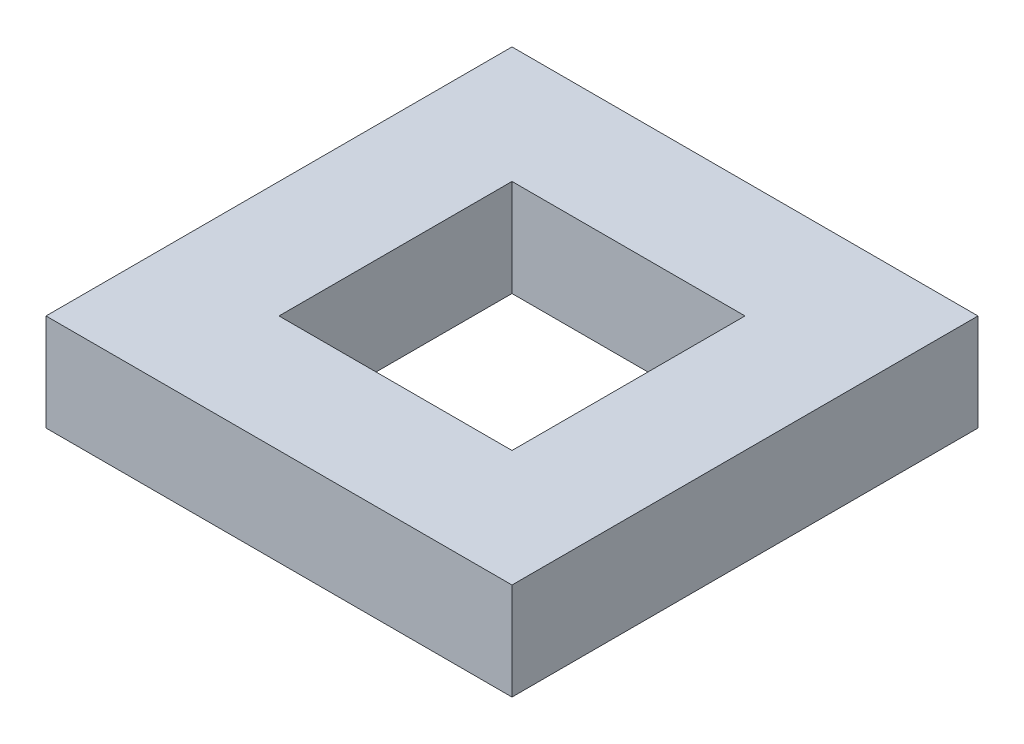
ISO-10303-21;
HEADER;
FILE_DESCRIPTION(('STEP AP214'),'2;1');
FILE_NAME('part.step','',(''),(''),'','','');
FILE_SCHEMA(('AUTOMOTIVE_DESIGN { 1 0 10303 214 1 1 1 1 }'));
ENDSEC;
DATA;
#1=APPLICATION_CONTEXT('core data for automotive mechanical design processes');
#2=APPLICATION_PROTOCOL_DEFINITION('international standard','automotive_design',2000,#1);
#3=PRODUCT_CONTEXT('',#1,'mechanical');
#4=PRODUCT('Part','Part','',(#3));
#5=PRODUCT_RELATED_PRODUCT_CATEGORY('part','',(#4));
#6=PRODUCT_DEFINITION_FORMATION('','',#4);
#7=PRODUCT_DEFINITION_CONTEXT('part definition',#1,'design');
#8=PRODUCT_DEFINITION('design','',#6,#7);
#9=PRODUCT_DEFINITION_SHAPE('','',#8);
#10=(LENGTH_UNIT() NAMED_UNIT(*) SI_UNIT(.MILLI.,.METRE.));
#11=(NAMED_UNIT(*) PLANE_ANGLE_UNIT() SI_UNIT($,.RADIAN.));
#12=(NAMED_UNIT(*) SI_UNIT($,.STERADIAN.) SOLID_ANGLE_UNIT());
#13=UNCERTAINTY_MEASURE_WITH_UNIT(LENGTH_MEASURE(1.E-05),#10,'distance_accuracy_value','');
#14=(GEOMETRIC_REPRESENTATION_CONTEXT(3) GLOBAL_UNCERTAINTY_ASSIGNED_CONTEXT((#13)) GLOBAL_UNIT_ASSIGNED_CONTEXT((#10,
#11,#12)) REPRESENTATION_CONTEXT('',''));
#15=CARTESIAN_POINT('',(0.,0.,0.));
#16=DIRECTION('',(0.,0.,1.));
#17=DIRECTION('',(1.,0.,0.));
#18=AXIS2_PLACEMENT_3D('',#15,#16,#17);
#19=CARTESIAN_POINT('',(0.,3.175,0.));
#20=DIRECTION('',(0.,-1.,0.));
#21=DIRECTION('',(0.,0.,-1.));
#22=AXIS2_PLACEMENT_3D('',#19,#20,#21);
#23=PLANE('',#22);
#24=DIRECTION('',(0.,0.,1.));
#25=VECTOR('',#24,1.);
#26=CARTESIAN_POINT('',(0.,3.175,0.));
#27=LINE('',#26,#25);
#28=CARTESIAN_POINT('',(0.,3.175,-15.24));
#29=VERTEX_POINT('',#28);
#30=CARTESIAN_POINT('',(0.,3.175,0.));
#31=VERTEX_POINT('',#30);
#32=EDGE_CURVE('E134',#29,#31,#27,.T.);
#33=ORIENTED_EDGE('',*,*,#32,.T.);
#34=DIRECTION('',(1.,0.,0.));
#35=VECTOR('',#34,1.);
#36=CARTESIAN_POINT('',(0.,3.175,0.));
#37=LINE('',#36,#35);
#38=CARTESIAN_POINT('',(15.24,3.175,0.));
#39=VERTEX_POINT('',#38);
#40=EDGE_CURVE('E137',#31,#39,#37,.T.);
#41=ORIENTED_EDGE('',*,*,#40,.T.);
#42=DIRECTION('',(0.,0.,-1.));
#43=VECTOR('',#42,1.);
#44=CARTESIAN_POINT('',(15.24,3.175,0.));
#45=LINE('',#44,#43);
#46=CARTESIAN_POINT('',(15.24,3.175,-15.24));
#47=VERTEX_POINT('',#46);
#48=EDGE_CURVE('E140',#39,#47,#45,.T.);
#49=ORIENTED_EDGE('',*,*,#48,.T.);
#50=DIRECTION('',(-1.,0.,0.));
#51=VECTOR('',#50,1.);
#52=CARTESIAN_POINT('',(0.,3.175,-15.24));
#53=LINE('',#52,#51);
#54=EDGE_CURVE('E142',#47,#29,#53,.T.);
#55=ORIENTED_EDGE('',*,*,#54,.T.);
#56=EDGE_LOOP('',(#33,#41,#49,#55));
#57=FACE_BOUND('',#56,.T.);
#58=DIRECTION('',(0.,0.,1.));
#59=VECTOR('',#58,1.);
#60=CARTESIAN_POINT('',(3.81,3.175,-3.81));
#61=LINE('',#60,#59);
#62=CARTESIAN_POINT('',(3.81,3.175,-11.43));
#63=VERTEX_POINT('',#62);
#64=CARTESIAN_POINT('',(3.81,3.175,-3.81));
#65=VERTEX_POINT('',#64);
#66=EDGE_CURVE('E98',#63,#65,#61,.T.);
#67=ORIENTED_EDGE('',*,*,#66,.F.);
#68=DIRECTION('',(-1.,0.,0.));
#69=VECTOR('',#68,1.);
#70=CARTESIAN_POINT('',(3.81,3.175,-11.43));
#71=LINE('',#70,#69);
#72=CARTESIAN_POINT('',(11.43,3.175,-11.43));
#73=VERTEX_POINT('',#72);
#74=EDGE_CURVE('E120',#73,#63,#71,.T.);
#75=ORIENTED_EDGE('',*,*,#74,.F.);
#76=DIRECTION('',(0.,0.,-1.));
#77=VECTOR('',#76,1.);
#78=CARTESIAN_POINT('',(11.43,3.175,-3.81));
#79=LINE('',#78,#77);
#80=CARTESIAN_POINT('',(11.43,3.175,-3.81));
#81=VERTEX_POINT('',#80);
#82=EDGE_CURVE('E118',#81,#73,#79,.T.);
#83=ORIENTED_EDGE('',*,*,#82,.F.);
#84=DIRECTION('',(1.,0.,0.));
#85=VECTOR('',#84,1.);
#86=CARTESIAN_POINT('',(3.81,3.175,-3.81));
#87=LINE('',#86,#85);
#88=EDGE_CURVE('E106',#65,#81,#87,.T.);
#89=ORIENTED_EDGE('',*,*,#88,.F.);
#90=EDGE_LOOP('',(#67,#75,#83,#89));
#91=FACE_BOUND('',#90,.T.);
#92=ADVANCED_FACE('F33',(#57,#91),#23,.F.);
#93=CARTESIAN_POINT('',(0.,0.,0.));
#94=DIRECTION('',(0.,-1.,0.));
#95=DIRECTION('',(0.,0.,-1.));
#96=AXIS2_PLACEMENT_3D('',#93,#94,#95);
#97=PLANE('',#96);
#98=DIRECTION('',(0.,0.,1.));
#99=VECTOR('',#98,1.);
#100=CARTESIAN_POINT('',(0.,0.,0.));
#101=LINE('',#100,#99);
#102=CARTESIAN_POINT('',(0.,0.,-15.24));
#103=VERTEX_POINT('',#102);
#104=CARTESIAN_POINT('',(0.,0.,0.));
#105=VERTEX_POINT('',#104);
#106=EDGE_CURVE('E114',#103,#105,#101,.T.);
#107=ORIENTED_EDGE('',*,*,#106,.F.);
#108=DIRECTION('',(-1.,0.,0.));
#109=VECTOR('',#108,1.);
#110=CARTESIAN_POINT('',(0.,0.,-15.24));
#111=LINE('',#110,#109);
#112=CARTESIAN_POINT('',(15.24,0.,-15.24));
#113=VERTEX_POINT('',#112);
#114=EDGE_CURVE('E138',#113,#103,#111,.T.);
#115=ORIENTED_EDGE('',*,*,#114,.F.);
#116=DIRECTION('',(0.,0.,-1.));
#117=VECTOR('',#116,1.);
#118=CARTESIAN_POINT('',(15.24,0.,0.));
#119=LINE('',#118,#117);
#120=CARTESIAN_POINT('',(15.24,0.,0.));
#121=VERTEX_POINT('',#120);
#122=EDGE_CURVE('E149',#121,#113,#119,.T.);
#123=ORIENTED_EDGE('',*,*,#122,.F.);
#124=DIRECTION('',(1.,0.,0.));
#125=VECTOR('',#124,1.);
#126=CARTESIAN_POINT('',(0.,0.,0.));
#127=LINE('',#126,#125);
#128=EDGE_CURVE('E147',#105,#121,#127,.T.);
#129=ORIENTED_EDGE('',*,*,#128,.F.);
#130=EDGE_LOOP('',(#107,#115,#123,#129));
#131=FACE_BOUND('',#130,.T.);
#132=DIRECTION('',(-1.,0.,0.));
#133=VECTOR('',#132,1.);
#134=CARTESIAN_POINT('',(3.81,0.,-11.43));
#135=LINE('',#134,#133);
#136=CARTESIAN_POINT('',(11.43,0.,-11.43));
#137=VERTEX_POINT('',#136);
#138=CARTESIAN_POINT('',(3.81,0.,-11.43));
#139=VERTEX_POINT('',#138);
#140=EDGE_CURVE('E107',#137,#139,#135,.T.);
#141=ORIENTED_EDGE('',*,*,#140,.T.);
#142=DIRECTION('',(0.,0.,1.));
#143=VECTOR('',#142,1.);
#144=CARTESIAN_POINT('',(3.81,0.,-3.81));
#145=LINE('',#144,#143);
#146=CARTESIAN_POINT('',(3.81,0.,-3.81));
#147=VERTEX_POINT('',#146);
#148=EDGE_CURVE('E56',#139,#147,#145,.T.);
#149=ORIENTED_EDGE('',*,*,#148,.T.);
#150=DIRECTION('',(1.,0.,0.));
#151=VECTOR('',#150,1.);
#152=CARTESIAN_POINT('',(3.81,0.,-3.81));
#153=LINE('',#152,#151);
#154=CARTESIAN_POINT('',(11.43,0.,-3.81));
#155=VERTEX_POINT('',#154);
#156=EDGE_CURVE('E113',#147,#155,#153,.T.);
#157=ORIENTED_EDGE('',*,*,#156,.T.);
#158=DIRECTION('',(0.,0.,-1.));
#159=VECTOR('',#158,1.);
#160=CARTESIAN_POINT('',(11.43,0.,-3.81));
#161=LINE('',#160,#159);
#162=EDGE_CURVE('E126',#155,#137,#161,.T.);
#163=ORIENTED_EDGE('',*,*,#162,.T.);
#164=EDGE_LOOP('',(#141,#149,#157,#163));
#165=FACE_BOUND('',#164,.T.);
#166=ADVANCED_FACE('F167',(#131,#165),#97,.T.);
#167=CARTESIAN_POINT('',(0.,3.175,0.));
#168=DIRECTION('',(1.,0.,0.));
#169=DIRECTION('',(0.,0.,-1.));
#170=AXIS2_PLACEMENT_3D('',#167,#168,#169);
#171=PLANE('',#170);
#172=ORIENTED_EDGE('',*,*,#106,.T.);
#173=DIRECTION('',(0.,-1.,0.));
#174=VECTOR('',#173,1.);
#175=CARTESIAN_POINT('',(0.,3.175,0.));
#176=LINE('',#175,#174);
#177=EDGE_CURVE('E11',#31,#105,#176,.T.);
#178=ORIENTED_EDGE('',*,*,#177,.F.);
#179=ORIENTED_EDGE('',*,*,#32,.F.);
#180=DIRECTION('',(0.,-1.,0.));
#181=VECTOR('',#180,1.);
#182=CARTESIAN_POINT('',(0.,3.175,-15.24));
#183=LINE('',#182,#181);
#184=EDGE_CURVE('E144',#29,#103,#183,.T.);
#185=ORIENTED_EDGE('',*,*,#184,.T.);
#186=EDGE_LOOP('',(#172,#178,#179,#185));
#187=FACE_BOUND('',#186,.T.);
#188=ADVANCED_FACE('F35',(#187),#171,.F.);
#189=CARTESIAN_POINT('',(0.,3.175,0.));
#190=DIRECTION('',(0.,0.,-1.));
#191=DIRECTION('',(-1.,0.,0.));
#192=AXIS2_PLACEMENT_3D('',#189,#190,#191);
#193=PLANE('',#192);
#194=ORIENTED_EDGE('',*,*,#128,.T.);
#195=DIRECTION('',(0.,-1.,0.));
#196=VECTOR('',#195,1.);
#197=CARTESIAN_POINT('',(15.24,3.175,0.));
#198=LINE('',#197,#196);
#199=EDGE_CURVE('E41',#39,#121,#198,.T.);
#200=ORIENTED_EDGE('',*,*,#199,.F.);
#201=ORIENTED_EDGE('',*,*,#40,.F.);
#202=ORIENTED_EDGE('',*,*,#177,.T.);
#203=EDGE_LOOP('',(#194,#200,#201,#202));
#204=FACE_BOUND('',#203,.T.);
#205=ADVANCED_FACE('F177',(#204),#193,.F.);
#206=CARTESIAN_POINT('',(15.24,3.175,0.));
#207=DIRECTION('',(-1.,0.,0.));
#208=DIRECTION('',(0.,0.,1.));
#209=AXIS2_PLACEMENT_3D('',#206,#207,#208);
#210=PLANE('',#209);
#211=ORIENTED_EDGE('',*,*,#122,.T.);
#212=DIRECTION('',(0.,-1.,0.));
#213=VECTOR('',#212,1.);
#214=CARTESIAN_POINT('',(15.24,3.175,-15.24));
#215=LINE('',#214,#213);
#216=EDGE_CURVE('E154',#47,#113,#215,.T.);
#217=ORIENTED_EDGE('',*,*,#216,.F.);
#218=ORIENTED_EDGE('',*,*,#48,.F.);
#219=ORIENTED_EDGE('',*,*,#199,.T.);
#220=EDGE_LOOP('',(#211,#217,#218,#219));
#221=FACE_BOUND('',#220,.T.);
#222=ADVANCED_FACE('F161',(#221),#210,.F.);
#223=CARTESIAN_POINT('',(0.,3.175,-15.24));
#224=DIRECTION('',(0.,0.,1.));
#225=DIRECTION('',(1.,0.,0.));
#226=AXIS2_PLACEMENT_3D('',#223,#224,#225);
#227=PLANE('',#226);
#228=ORIENTED_EDGE('',*,*,#114,.T.);
#229=ORIENTED_EDGE('',*,*,#184,.F.);
#230=ORIENTED_EDGE('',*,*,#54,.F.);
#231=ORIENTED_EDGE('',*,*,#216,.T.);
#232=EDGE_LOOP('',(#228,#229,#230,#231));
#233=FACE_BOUND('',#232,.T.);
#234=ADVANCED_FACE('F171',(#233),#227,.F.);
#235=CARTESIAN_POINT('',(3.81,3.175,-3.81));
#236=DIRECTION('',(1.,0.,0.));
#237=DIRECTION('',(0.,0.,-1.));
#238=AXIS2_PLACEMENT_3D('',#235,#236,#237);
#239=PLANE('',#238);
#240=ORIENTED_EDGE('',*,*,#148,.F.);
#241=DIRECTION('',(0.,-1.,0.));
#242=VECTOR('',#241,1.);
#243=CARTESIAN_POINT('',(3.81,3.175,-11.43));
#244=LINE('',#243,#242);
#245=EDGE_CURVE('E102',#63,#139,#244,.T.);
#246=ORIENTED_EDGE('',*,*,#245,.F.);
#247=ORIENTED_EDGE('',*,*,#66,.T.);
#248=DIRECTION('',(0.,-1.,0.));
#249=VECTOR('',#248,1.);
#250=CARTESIAN_POINT('',(3.81,3.175,-3.81));
#251=LINE('',#250,#249);
#252=EDGE_CURVE('E101',#65,#147,#251,.T.);
#253=ORIENTED_EDGE('',*,*,#252,.T.);
#254=EDGE_LOOP('',(#240,#246,#247,#253));
#255=FACE_BOUND('',#254,.T.);
#256=ADVANCED_FACE('F100',(#255),#239,.T.);
#257=CARTESIAN_POINT('',(3.81,3.175,-3.81));
#258=DIRECTION('',(0.,0.,-1.));
#259=DIRECTION('',(-1.,0.,0.));
#260=AXIS2_PLACEMENT_3D('',#257,#258,#259);
#261=PLANE('',#260);
#262=ORIENTED_EDGE('',*,*,#156,.F.);
#263=ORIENTED_EDGE('',*,*,#252,.F.);
#264=ORIENTED_EDGE('',*,*,#88,.T.);
#265=DIRECTION('',(0.,-1.,0.));
#266=VECTOR('',#265,1.);
#267=CARTESIAN_POINT('',(11.43,3.175,-3.81));
#268=LINE('',#267,#266);
#269=EDGE_CURVE('E115',#81,#155,#268,.T.);
#270=ORIENTED_EDGE('',*,*,#269,.T.);
#271=EDGE_LOOP('',(#262,#263,#264,#270));
#272=FACE_BOUND('',#271,.T.);
#273=ADVANCED_FACE('F110',(#272),#261,.T.);
#274=CARTESIAN_POINT('',(11.43,3.175,-3.81));
#275=DIRECTION('',(-1.,0.,0.));
#276=DIRECTION('',(0.,0.,1.));
#277=AXIS2_PLACEMENT_3D('',#274,#275,#276);
#278=PLANE('',#277);
#279=ORIENTED_EDGE('',*,*,#162,.F.);
#280=ORIENTED_EDGE('',*,*,#269,.F.);
#281=ORIENTED_EDGE('',*,*,#82,.T.);
#282=DIRECTION('',(0.,-1.,0.));
#283=VECTOR('',#282,1.);
#284=CARTESIAN_POINT('',(11.43,3.175,-11.43));
#285=LINE('',#284,#283);
#286=EDGE_CURVE('E48',#73,#137,#285,.T.);
#287=ORIENTED_EDGE('',*,*,#286,.T.);
#288=EDGE_LOOP('',(#279,#280,#281,#287));
#289=FACE_BOUND('',#288,.T.);
#290=ADVANCED_FACE('F200',(#289),#278,.T.);
#291=CARTESIAN_POINT('',(3.81,3.175,-11.43));
#292=DIRECTION('',(0.,0.,1.));
#293=DIRECTION('',(1.,0.,0.));
#294=AXIS2_PLACEMENT_3D('',#291,#292,#293);
#295=PLANE('',#294);
#296=ORIENTED_EDGE('',*,*,#140,.F.);
#297=ORIENTED_EDGE('',*,*,#286,.F.);
#298=ORIENTED_EDGE('',*,*,#74,.T.);
#299=ORIENTED_EDGE('',*,*,#245,.T.);
#300=EDGE_LOOP('',(#296,#297,#298,#299));
#301=FACE_BOUND('',#300,.T.);
#302=ADVANCED_FACE('F204',(#301),#295,.T.);
#303=CLOSED_SHELL('',(#92,#166,#188,#205,#222,#234,#256,#273,#290,#302));
#304=MANIFOLD_SOLID_BREP('B2',#303);
#305=ADVANCED_BREP_SHAPE_REPRESENTATION('',(#18,#304),#14);
#306=SHAPE_DEFINITION_REPRESENTATION(#9,#305);
ENDSEC;
END-ISO-10303-21;
